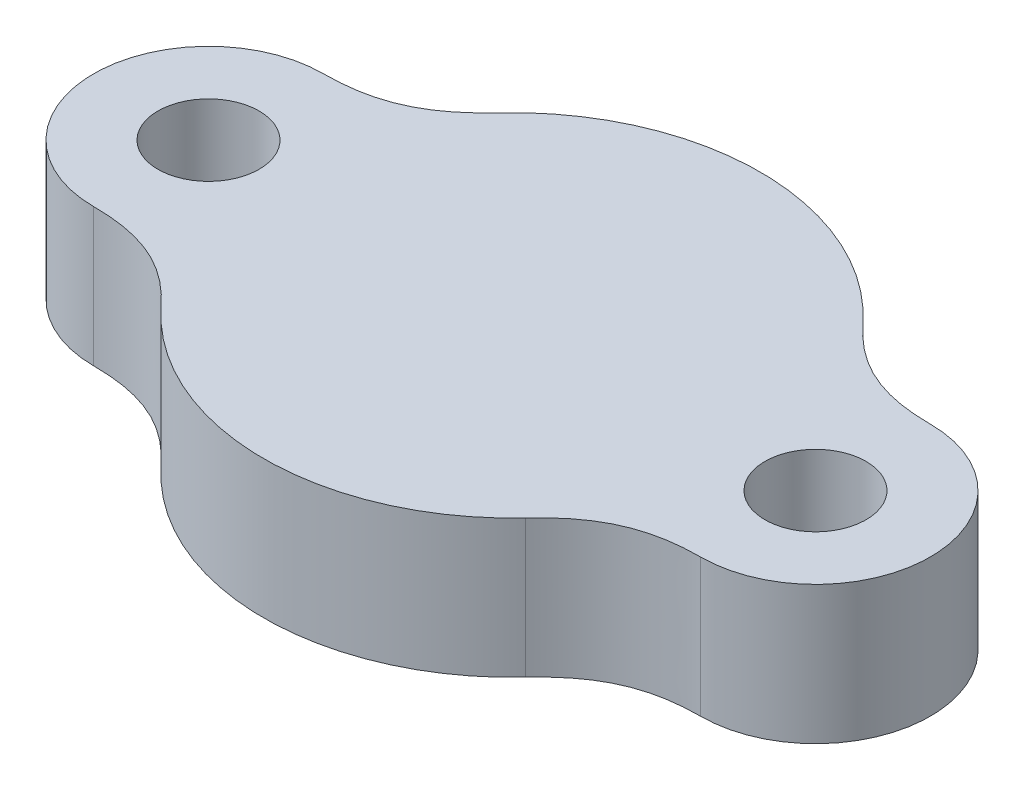
ISO-10303-21;
HEADER;
FILE_DESCRIPTION(('STEP AP214'),'2;1');
FILE_NAME('part.step','',(''),(''),'','','');
FILE_SCHEMA(('AUTOMOTIVE_DESIGN { 1 0 10303 214 1 1 1 1 }'));
ENDSEC;
DATA;
#1=APPLICATION_CONTEXT('core data for automotive mechanical design processes');
#2=APPLICATION_PROTOCOL_DEFINITION('international standard','automotive_design',2000,#1);
#3=PRODUCT_CONTEXT('',#1,'mechanical');
#4=PRODUCT('Part','Part','',(#3));
#5=PRODUCT_RELATED_PRODUCT_CATEGORY('part','',(#4));
#6=PRODUCT_DEFINITION_FORMATION('','',#4);
#7=PRODUCT_DEFINITION_CONTEXT('part definition',#1,'design');
#8=PRODUCT_DEFINITION('design','',#6,#7);
#9=PRODUCT_DEFINITION_SHAPE('','',#8);
#10=(LENGTH_UNIT() NAMED_UNIT(*) SI_UNIT(.MILLI.,.METRE.));
#11=(NAMED_UNIT(*) PLANE_ANGLE_UNIT() SI_UNIT($,.RADIAN.));
#12=(NAMED_UNIT(*) SI_UNIT($,.STERADIAN.) SOLID_ANGLE_UNIT());
#13=UNCERTAINTY_MEASURE_WITH_UNIT(LENGTH_MEASURE(1.E-05),#10,'distance_accuracy_value','');
#14=(GEOMETRIC_REPRESENTATION_CONTEXT(3) GLOBAL_UNCERTAINTY_ASSIGNED_CONTEXT((#13)) GLOBAL_UNIT_ASSIGNED_CONTEXT((#10,
#11,#12)) REPRESENTATION_CONTEXT('',''));
#15=CARTESIAN_POINT('',(0.,0.,0.));
#16=DIRECTION('',(0.,0.,1.));
#17=DIRECTION('',(1.,0.,0.));
#18=AXIS2_PLACEMENT_3D('',#15,#16,#17);
#19=CARTESIAN_POINT('',(0.,8.57491052322613,0.));
#20=DIRECTION('',(0.,1.,0.));
#21=DIRECTION('',(0.,0.,1.));
#22=AXIS2_PLACEMENT_3D('',#19,#20,#21);
#23=CYLINDRICAL_SURFACE('',#22,5.39961623137138);
#24=CARTESIAN_POINT('',(0.,-2.3975,0.));
#25=DIRECTION('',(0.,-1.,0.));
#26=DIRECTION('',(0.,0.,-1.));
#27=AXIS2_PLACEMENT_3D('',#24,#25,#26);
#28=CIRCLE('',#27,5.39961623137138);
#29=CARTESIAN_POINT('',(3.95984253467832,-2.3975,-3.67089941930334));
#30=VERTEX_POINT('',#29);
#31=CARTESIAN_POINT('',(-3.95984253467832,-2.3975,-3.67089941930334));
#32=VERTEX_POINT('',#31);
#33=EDGE_CURVE('E175',#30,#32,#28,.F.);
#34=ORIENTED_EDGE('',*,*,#33,.F.);
#35=DIRECTION('',(0.,-1.,0.));
#36=VECTOR('',#35,1.);
#37=CARTESIAN_POINT('',(3.95984253467832,2.6025,-3.67089941930334));
#38=LINE('',#37,#36);
#39=CARTESIAN_POINT('',(3.95984253467832,-5.3975,-3.67089941930334));
#40=VERTEX_POINT('',#39);
#41=EDGE_CURVE('E52',#30,#40,#38,.T.);
#42=ORIENTED_EDGE('',*,*,#41,.T.);
#43=CARTESIAN_POINT('',(0.,-5.3975,0.));
#44=DIRECTION('',(0.,1.,0.));
#45=DIRECTION('',(0.,0.,1.));
#46=AXIS2_PLACEMENT_3D('',#43,#44,#45);
#47=CIRCLE('',#46,5.39961623137138);
#48=CARTESIAN_POINT('',(-3.95984253467832,-5.3975,-3.67089941930334));
#49=VERTEX_POINT('',#48);
#50=EDGE_CURVE('E45',#40,#49,#47,.T.);
#51=ORIENTED_EDGE('',*,*,#50,.T.);
#52=DIRECTION('',(0.,-1.,0.));
#53=VECTOR('',#52,1.);
#54=CARTESIAN_POINT('',(-3.95984253467832,2.6025,-3.67089941930334));
#55=LINE('',#54,#53);
#56=EDGE_CURVE('E176',#32,#49,#55,.T.);
#57=ORIENTED_EDGE('',*,*,#56,.F.);
#58=EDGE_LOOP('',(#34,#42,#51,#57));
#59=FACE_BOUND('',#58,.T.);
#60=ADVANCED_FACE('F36',(#59),#23,.T.);
#61=CARTESIAN_POINT('',(-6.6,2.6025,-2.5));
#62=CARTESIAN_POINT('',(-5.36231166563302,2.6025,-2.5));
#63=CARTESIAN_POINT('',(-4.63638579948082,2.6025,-2.94110421368491));
#64=CARTESIAN_POINT('',(-3.95984253467832,2.6025,-3.67089941930334));
#65=B_SPLINE_CURVE_WITH_KNOTS('',3,(#61,#62,#63,#64),.UNSPECIFIED.,.F.,.F.,(4,4),(0.,1.),.UNSPECIFIED.);
#66=DIRECTION('',(0.,-1.,0.));
#67=VECTOR('',#66,1.);
#68=SURFACE_OF_LINEAR_EXTRUSION('',#65,#67);
#69=CARTESIAN_POINT('',(-6.6,-2.3975,-2.5));
#70=CARTESIAN_POINT('',(-5.36231166563302,-2.3975,-2.5));
#71=CARTESIAN_POINT('',(-4.63638579948082,-2.3975,-2.94110421368491));
#72=CARTESIAN_POINT('',(-3.95984253467832,-2.3975,-3.67089941930334));
#73=B_SPLINE_CURVE_WITH_KNOTS('',3,(#69,#70,#71,#72),.UNSPECIFIED.,.F.,.F.,(4,4),(0.,1.),.UNSPECIFIED.);
#74=CARTESIAN_POINT('',(-6.6,-2.3975,-2.5));
#75=VERTEX_POINT('',#74);
#76=EDGE_CURVE('E181',#32,#75,#73,.F.);
#77=ORIENTED_EDGE('',*,*,#76,.F.);
#78=ORIENTED_EDGE('',*,*,#56,.T.);
#79=CARTESIAN_POINT('',(-6.6,-5.3975,-2.5));
#80=CARTESIAN_POINT('',(-5.36231166563302,-5.3975,-2.5));
#81=CARTESIAN_POINT('',(-4.63638579948082,-5.3975,-2.94110421368491));
#82=CARTESIAN_POINT('',(-3.95984253467832,-5.3975,-3.67089941930334));
#83=B_SPLINE_CURVE_WITH_KNOTS('',3,(#79,#80,#81,#82),.UNSPECIFIED.,.F.,.F.,(4,4),(0.,1.),.UNSPECIFIED.);
#84=CARTESIAN_POINT('',(-6.6,-5.3975,-2.5));
#85=VERTEX_POINT('',#84);
#86=EDGE_CURVE('E324',#85,#49,#83,.T.);
#87=ORIENTED_EDGE('',*,*,#86,.F.);
#88=DIRECTION('',(0.,-1.,0.));
#89=VECTOR('',#88,1.);
#90=CARTESIAN_POINT('',(-6.6,2.6025,-2.5));
#91=LINE('',#90,#89);
#92=EDGE_CURVE('E320',#75,#85,#91,.T.);
#93=ORIENTED_EDGE('',*,*,#92,.F.);
#94=EDGE_LOOP('',(#77,#78,#87,#93));
#95=FACE_BOUND('',#94,.T.);
#96=ADVANCED_FACE('F169',(#95),#68,.T.);
#97=CARTESIAN_POINT('',(-6.6,2.6025,0.));
#98=DIRECTION('',(0.,-1.,0.));
#99=DIRECTION('',(0.,0.,-1.));
#100=AXIS2_PLACEMENT_3D('',#97,#98,#99);
#101=CYLINDRICAL_SURFACE('',#100,2.5);
#102=DIRECTION('',(0.,-1.,0.));
#103=VECTOR('',#102,1.);
#104=CARTESIAN_POINT('',(-6.6,2.6025,2.5));
#105=LINE('',#104,#103);
#106=CARTESIAN_POINT('',(-6.6,-2.3975,2.5));
#107=VERTEX_POINT('',#106);
#108=CARTESIAN_POINT('',(-6.6,-5.3975,2.5));
#109=VERTEX_POINT('',#108);
#110=EDGE_CURVE('E314',#107,#109,#105,.T.);
#111=ORIENTED_EDGE('',*,*,#110,.F.);
#112=CARTESIAN_POINT('',(-6.6,-2.3975,0.));
#113=DIRECTION('',(0.,-1.,0.));
#114=DIRECTION('',(0.,0.,-1.));
#115=AXIS2_PLACEMENT_3D('',#112,#113,#114);
#116=CIRCLE('',#115,2.5);
#117=EDGE_CURVE('E178',#75,#107,#116,.F.);
#118=ORIENTED_EDGE('',*,*,#117,.F.);
#119=ORIENTED_EDGE('',*,*,#92,.T.);
#120=CARTESIAN_POINT('',(-6.6,-5.3975,0.));
#121=DIRECTION('',(0.,-1.,0.));
#122=DIRECTION('',(0.,0.,-1.));
#123=AXIS2_PLACEMENT_3D('',#120,#121,#122);
#124=CIRCLE('',#123,2.5);
#125=EDGE_CURVE('E317',#109,#85,#124,.T.);
#126=ORIENTED_EDGE('',*,*,#125,.F.);
#127=EDGE_LOOP('',(#111,#118,#119,#126));
#128=FACE_BOUND('',#127,.T.);
#129=ADVANCED_FACE('F152',(#128),#101,.T.);
#130=CARTESIAN_POINT('',(-6.6,2.6025,0.));
#131=DIRECTION('',(0.,-1.,0.));
#132=DIRECTION('',(0.,0.,-1.));
#133=AXIS2_PLACEMENT_3D('',#130,#131,#132);
#134=CYLINDRICAL_SURFACE('',#133,1.1);
#135=CARTESIAN_POINT('',(-6.6,-2.3975,0.));
#136=DIRECTION('',(0.,-1.,0.));
#137=DIRECTION('',(0.,0.,-1.));
#138=AXIS2_PLACEMENT_3D('',#135,#136,#137);
#139=CIRCLE('',#138,1.1);
#140=CARTESIAN_POINT('',(-6.6,-2.3975,-1.1));
#141=VERTEX_POINT('',#140);
#142=EDGE_CURVE('E189',#141,#141,#139,.F.);
#143=ORIENTED_EDGE('',*,*,#142,.T.);
#144=EDGE_LOOP('',(#143));
#145=FACE_BOUND('',#144,.T.);
#146=CARTESIAN_POINT('',(-6.6,-5.3975,0.));
#147=DIRECTION('',(0.,-1.,0.));
#148=DIRECTION('',(0.,0.,-1.));
#149=AXIS2_PLACEMENT_3D('',#146,#147,#148);
#150=CIRCLE('',#149,1.1);
#151=CARTESIAN_POINT('',(-6.6,-5.3975,-1.1));
#152=VERTEX_POINT('',#151);
#153=EDGE_CURVE('E339',#152,#152,#150,.T.);
#154=ORIENTED_EDGE('',*,*,#153,.T.);
#155=EDGE_LOOP('',(#154));
#156=FACE_BOUND('',#155,.T.);
#157=ADVANCED_FACE('F150',(#145,#156),#134,.F.);
#158=CARTESIAN_POINT('',(-6.6,2.6025,2.5));
#159=CARTESIAN_POINT('',(-5.36231166563302,2.6025,2.5));
#160=CARTESIAN_POINT('',(-4.63638579948082,2.6025,2.94110421368491));
#161=CARTESIAN_POINT('',(-3.95984253467832,2.6025,3.67089941930334));
#162=B_SPLINE_CURVE_WITH_KNOTS('',3,(#158,#159,#160,#161),.UNSPECIFIED.,.F.,.F.,(4,4),(0.,1.),.UNSPECIFIED.);
#163=DIRECTION('',(0.,-1.,0.));
#164=VECTOR('',#163,1.);
#165=SURFACE_OF_LINEAR_EXTRUSION('',#162,#164);
#166=DIRECTION('',(0.,-1.,0.));
#167=VECTOR('',#166,1.);
#168=CARTESIAN_POINT('',(-3.95984253467833,2.6025,3.67089941930334));
#169=LINE('',#168,#167);
#170=CARTESIAN_POINT('',(-3.95984253467832,-2.3975,3.67089941930334));
#171=VERTEX_POINT('',#170);
#172=CARTESIAN_POINT('',(-3.95984253467832,-5.3975,3.67089941930334));
#173=VERTEX_POINT('',#172);
#174=EDGE_CURVE('E321',#171,#173,#169,.T.);
#175=ORIENTED_EDGE('',*,*,#174,.F.);
#176=CARTESIAN_POINT('',(-6.6,-2.3975,2.5));
#177=CARTESIAN_POINT('',(-5.36231166563302,-2.3975,2.5));
#178=CARTESIAN_POINT('',(-4.63638579948082,-2.3975,2.94110421368491));
#179=CARTESIAN_POINT('',(-3.95984253467832,-2.3975,3.67089941930334));
#180=B_SPLINE_CURVE_WITH_KNOTS('',3,(#176,#177,#178,#179),.UNSPECIFIED.,.F.,.F.,(4,4),(0.,1.),.UNSPECIFIED.);
#181=EDGE_CURVE('E179',#171,#107,#180,.F.);
#182=ORIENTED_EDGE('',*,*,#181,.T.);
#183=ORIENTED_EDGE('',*,*,#110,.T.);
#184=CARTESIAN_POINT('',(-6.6,-5.3975,2.5));
#185=CARTESIAN_POINT('',(-5.36231166563302,-5.3975,2.5));
#186=CARTESIAN_POINT('',(-4.63638579948082,-5.3975,2.94110421368491));
#187=CARTESIAN_POINT('',(-3.95984253467832,-5.3975,3.67089941930334));
#188=B_SPLINE_CURVE_WITH_KNOTS('',3,(#184,#185,#186,#187),.UNSPECIFIED.,.F.,.F.,(4,4),(0.,1.),.UNSPECIFIED.);
#189=EDGE_CURVE('E336',#109,#173,#188,.T.);
#190=ORIENTED_EDGE('',*,*,#189,.T.);
#191=EDGE_LOOP('',(#175,#182,#183,#190));
#192=FACE_BOUND('',#191,.T.);
#193=ADVANCED_FACE('F146',(#192),#165,.F.);
#194=CARTESIAN_POINT('',(0.,-2.3975,0.));
#195=DIRECTION('',(0.,-1.,0.));
#196=DIRECTION('',(0.,0.,-1.));
#197=AXIS2_PLACEMENT_3D('',#194,#195,#196);
#198=CIRCLE('',#197,5.39961623137138);
#199=CARTESIAN_POINT('',(3.95984253467832,-2.3975,3.67089941930334));
#200=VERTEX_POINT('',#199);
#201=EDGE_CURVE('E119',#171,#200,#198,.F.);
#202=ORIENTED_EDGE('',*,*,#201,.F.);
#203=ORIENTED_EDGE('',*,*,#174,.T.);
#204=CARTESIAN_POINT('',(3.95984253467832,-5.3975,3.67089941930334));
#205=VERTEX_POINT('',#204);
#206=EDGE_CURVE('E11',#173,#205,#47,.T.);
#207=ORIENTED_EDGE('',*,*,#206,.T.);
#208=DIRECTION('',(0.,-1.,0.));
#209=VECTOR('',#208,1.);
#210=CARTESIAN_POINT('',(3.95984253467832,2.6025,3.67089941930334));
#211=LINE('',#210,#209);
#212=EDGE_CURVE('E60',#200,#205,#211,.T.);
#213=ORIENTED_EDGE('',*,*,#212,.F.);
#214=EDGE_LOOP('',(#202,#203,#207,#213));
#215=FACE_BOUND('',#214,.T.);
#216=ADVANCED_FACE('F38',(#215),#23,.T.);
#217=CARTESIAN_POINT('',(0.,-5.3975,0.));
#218=DIRECTION('',(0.,-1.,0.));
#219=DIRECTION('',(0.,0.,-1.));
#220=AXIS2_PLACEMENT_3D('',#217,#218,#219);
#221=PLANE('',#220);
#222=ORIENTED_EDGE('',*,*,#206,.F.);
#223=ORIENTED_EDGE('',*,*,#189,.F.);
#224=ORIENTED_EDGE('',*,*,#125,.T.);
#225=ORIENTED_EDGE('',*,*,#86,.T.);
#226=ORIENTED_EDGE('',*,*,#50,.F.);
#227=CARTESIAN_POINT('',(6.6,-5.3975,-2.5));
#228=CARTESIAN_POINT('',(5.36231166563302,-5.3975,-2.5));
#229=CARTESIAN_POINT('',(4.63638579948082,-5.3975,-2.94110421368491));
#230=CARTESIAN_POINT('',(3.95984253467832,-5.3975,-3.67089941930334));
#231=B_SPLINE_CURVE_WITH_KNOTS('',3,(#227,#228,#229,#230),.UNSPECIFIED.,.F.,.F.,(4,4),(0.,1.),.UNSPECIFIED.);
#232=CARTESIAN_POINT('',(6.6,-5.3975,-2.5));
#233=VERTEX_POINT('',#232);
#234=EDGE_CURVE('E195',#233,#40,#231,.T.);
#235=ORIENTED_EDGE('',*,*,#234,.F.);
#236=CARTESIAN_POINT('',(6.6,-5.3975,0.));
#237=DIRECTION('',(0.,-1.,0.));
#238=DIRECTION('',(0.,0.,-1.));
#239=AXIS2_PLACEMENT_3D('',#236,#237,#238);
#240=CIRCLE('',#239,2.5);
#241=CARTESIAN_POINT('',(6.6,-5.3975,2.5));
#242=VERTEX_POINT('',#241);
#243=EDGE_CURVE('E123',#242,#233,#240,.F.);
#244=ORIENTED_EDGE('',*,*,#243,.F.);
#245=CARTESIAN_POINT('',(6.6,-5.3975,2.5));
#246=CARTESIAN_POINT('',(5.36231166563302,-5.3975,2.5));
#247=CARTESIAN_POINT('',(4.63638579948082,-5.3975,2.94110421368491));
#248=CARTESIAN_POINT('',(3.95984253467832,-5.3975,3.67089941930334));
#249=B_SPLINE_CURVE_WITH_KNOTS('',3,(#245,#246,#247,#248),.UNSPECIFIED.,.F.,.F.,(4,4),(0.,1.),.UNSPECIFIED.);
#250=EDGE_CURVE('E130',#242,#205,#249,.T.);
#251=ORIENTED_EDGE('',*,*,#250,.T.);
#252=EDGE_LOOP('',(#222,#223,#224,#225,#226,#235,#244,#251));
#253=FACE_BOUND('',#252,.T.);
#254=ORIENTED_EDGE('',*,*,#153,.F.);
#255=EDGE_LOOP('',(#254));
#256=FACE_BOUND('',#255,.T.);
#257=CARTESIAN_POINT('',(6.6,-5.3975,0.));
#258=DIRECTION('',(0.,-1.,0.));
#259=DIRECTION('',(0.,0.,-1.));
#260=AXIS2_PLACEMENT_3D('',#257,#258,#259);
#261=CIRCLE('',#260,1.1);
#262=CARTESIAN_POINT('',(6.6,-5.3975,-1.1));
#263=VERTEX_POINT('',#262);
#264=EDGE_CURVE('E126',#263,#263,#261,.T.);
#265=ORIENTED_EDGE('',*,*,#264,.F.);
#266=EDGE_LOOP('',(#265));
#267=FACE_BOUND('',#266,.T.);
#268=ADVANCED_FACE('F156',(#253,#256,#267),#221,.T.);
#269=CARTESIAN_POINT('',(6.6,2.6025,-2.5));
#270=CARTESIAN_POINT('',(5.36231166563302,2.6025,-2.5));
#271=CARTESIAN_POINT('',(4.63638579948082,2.6025,-2.94110421368491));
#272=CARTESIAN_POINT('',(3.95984253467832,2.6025,-3.67089941930334));
#273=B_SPLINE_CURVE_WITH_KNOTS('',3,(#269,#270,#271,#272),.UNSPECIFIED.,.F.,.F.,(4,4),(0.,1.),.UNSPECIFIED.);
#274=DIRECTION('',(0.,-1.,0.));
#275=VECTOR('',#274,1.);
#276=SURFACE_OF_LINEAR_EXTRUSION('',#273,#275);
#277=ORIENTED_EDGE('',*,*,#41,.F.);
#278=CARTESIAN_POINT('',(6.6,-2.3975,-2.5));
#279=CARTESIAN_POINT('',(5.36231166563302,-2.3975,-2.5));
#280=CARTESIAN_POINT('',(4.63638579948082,-2.3975,-2.94110421368491));
#281=CARTESIAN_POINT('',(3.95984253467832,-2.3975,-3.67089941930334));
#282=B_SPLINE_CURVE_WITH_KNOTS('',3,(#278,#279,#280,#281),.UNSPECIFIED.,.F.,.F.,(4,4),(0.,1.),.UNSPECIFIED.);
#283=CARTESIAN_POINT('',(6.6,-2.3975,-2.5));
#284=VERTEX_POINT('',#283);
#285=EDGE_CURVE('E108',#30,#284,#282,.F.);
#286=ORIENTED_EDGE('',*,*,#285,.T.);
#287=DIRECTION('',(0.,-1.,0.));
#288=VECTOR('',#287,1.);
#289=CARTESIAN_POINT('',(6.6,2.6025,-2.5));
#290=LINE('',#289,#288);
#291=EDGE_CURVE('E117',#284,#233,#290,.T.);
#292=ORIENTED_EDGE('',*,*,#291,.T.);
#293=ORIENTED_EDGE('',*,*,#234,.T.);
#294=EDGE_LOOP('',(#277,#286,#292,#293));
#295=FACE_BOUND('',#294,.T.);
#296=ADVANCED_FACE('F115',(#295),#276,.F.);
#297=CARTESIAN_POINT('',(6.6,2.6025,2.5));
#298=CARTESIAN_POINT('',(5.36231166563302,2.6025,2.5));
#299=CARTESIAN_POINT('',(4.63638579948082,2.6025,2.94110421368491));
#300=CARTESIAN_POINT('',(3.95984253467832,2.6025,3.67089941930334));
#301=B_SPLINE_CURVE_WITH_KNOTS('',3,(#297,#298,#299,#300),.UNSPECIFIED.,.F.,.F.,(4,4),(0.,1.),.UNSPECIFIED.);
#302=DIRECTION('',(0.,-1.,0.));
#303=VECTOR('',#302,1.);
#304=SURFACE_OF_LINEAR_EXTRUSION('',#301,#303);
#305=CARTESIAN_POINT('',(6.6,-2.3975,2.5));
#306=CARTESIAN_POINT('',(5.36231166563302,-2.3975,2.5));
#307=CARTESIAN_POINT('',(4.63638579948082,-2.3975,2.94110421368491));
#308=CARTESIAN_POINT('',(3.95984253467832,-2.3975,3.67089941930334));
#309=B_SPLINE_CURVE_WITH_KNOTS('',3,(#305,#306,#307,#308),.UNSPECIFIED.,.F.,.F.,(4,4),(0.,1.),.UNSPECIFIED.);
#310=CARTESIAN_POINT('',(6.6,-2.3975,2.5));
#311=VERTEX_POINT('',#310);
#312=EDGE_CURVE('E109',#200,#311,#309,.F.);
#313=ORIENTED_EDGE('',*,*,#312,.F.);
#314=ORIENTED_EDGE('',*,*,#212,.T.);
#315=ORIENTED_EDGE('',*,*,#250,.F.);
#316=DIRECTION('',(0.,-1.,0.));
#317=VECTOR('',#316,1.);
#318=CARTESIAN_POINT('',(6.6,2.6025,2.5));
#319=LINE('',#318,#317);
#320=EDGE_CURVE('E125',#311,#242,#319,.T.);
#321=ORIENTED_EDGE('',*,*,#320,.F.);
#322=EDGE_LOOP('',(#313,#314,#315,#321));
#323=FACE_BOUND('',#322,.T.);
#324=ADVANCED_FACE('F163',(#323),#304,.T.);
#325=CARTESIAN_POINT('',(6.6,2.6025,0.));
#326=DIRECTION('',(0.,-1.,0.));
#327=DIRECTION('',(0.,0.,-1.));
#328=AXIS2_PLACEMENT_3D('',#325,#326,#327);
#329=CYLINDRICAL_SURFACE('',#328,2.5);
#330=CARTESIAN_POINT('',(6.6,-2.3975,0.));
#331=DIRECTION('',(0.,-1.,0.));
#332=DIRECTION('',(0.,0.,-1.));
#333=AXIS2_PLACEMENT_3D('',#330,#331,#332);
#334=CIRCLE('',#333,2.5);
#335=EDGE_CURVE('E104',#284,#311,#334,.T.);
#336=ORIENTED_EDGE('',*,*,#335,.T.);
#337=ORIENTED_EDGE('',*,*,#320,.T.);
#338=ORIENTED_EDGE('',*,*,#243,.T.);
#339=ORIENTED_EDGE('',*,*,#291,.F.);
#340=EDGE_LOOP('',(#336,#337,#338,#339));
#341=FACE_BOUND('',#340,.T.);
#342=ADVANCED_FACE('F121',(#341),#329,.T.);
#343=CARTESIAN_POINT('',(6.6,2.6025,0.));
#344=DIRECTION('',(0.,-1.,0.));
#345=DIRECTION('',(0.,0.,-1.));
#346=AXIS2_PLACEMENT_3D('',#343,#344,#345);
#347=CYLINDRICAL_SURFACE('',#346,1.1);
#348=CARTESIAN_POINT('',(6.6,-2.3975,0.));
#349=DIRECTION('',(0.,-1.,0.));
#350=DIRECTION('',(0.,0.,-1.));
#351=AXIS2_PLACEMENT_3D('',#348,#349,#350);
#352=CIRCLE('',#351,1.1);
#353=CARTESIAN_POINT('',(6.6,-2.3975,-1.1));
#354=VERTEX_POINT('',#353);
#355=EDGE_CURVE('E40',#354,#354,#352,.F.);
#356=ORIENTED_EDGE('',*,*,#355,.T.);
#357=EDGE_LOOP('',(#356));
#358=FACE_BOUND('',#357,.T.);
#359=ORIENTED_EDGE('',*,*,#264,.T.);
#360=EDGE_LOOP('',(#359));
#361=FACE_BOUND('',#360,.T.);
#362=ADVANCED_FACE('F210',(#358,#361),#347,.F.);
#363=CARTESIAN_POINT('',(0.,-2.3975,-5.41680899207826));
#364=DIRECTION('',(0.,-1.,0.));
#365=DIRECTION('',(0.,0.,-1.));
#366=AXIS2_PLACEMENT_3D('',#363,#364,#365);
#367=PLANE('',#366);
#368=ORIENTED_EDGE('',*,*,#355,.F.);
#369=EDGE_LOOP('',(#368));
#370=FACE_BOUND('',#369,.T.);
#371=ORIENTED_EDGE('',*,*,#76,.T.);
#372=ORIENTED_EDGE('',*,*,#117,.T.);
#373=ORIENTED_EDGE('',*,*,#181,.F.);
#374=ORIENTED_EDGE('',*,*,#201,.T.);
#375=ORIENTED_EDGE('',*,*,#312,.T.);
#376=ORIENTED_EDGE('',*,*,#335,.F.);
#377=ORIENTED_EDGE('',*,*,#285,.F.);
#378=ORIENTED_EDGE('',*,*,#33,.T.);
#379=EDGE_LOOP('',(#371,#372,#373,#374,#375,#376,#377,#378));
#380=FACE_BOUND('',#379,.T.);
#381=ORIENTED_EDGE('',*,*,#142,.F.);
#382=EDGE_LOOP('',(#381));
#383=FACE_BOUND('',#382,.T.);
#384=ADVANCED_FACE('F106',(#370,#380,#383),#367,.F.);
#385=CLOSED_SHELL('',(#60,#96,#129,#157,#193,#216,#268,#296,#324,#342,#362,#384));
#386=MANIFOLD_SOLID_BREP('B2',#385);
#387=ADVANCED_BREP_SHAPE_REPRESENTATION('',(#18,#386),#14);
#388=SHAPE_DEFINITION_REPRESENTATION(#9,#387);
ENDSEC;
END-ISO-10303-21;
